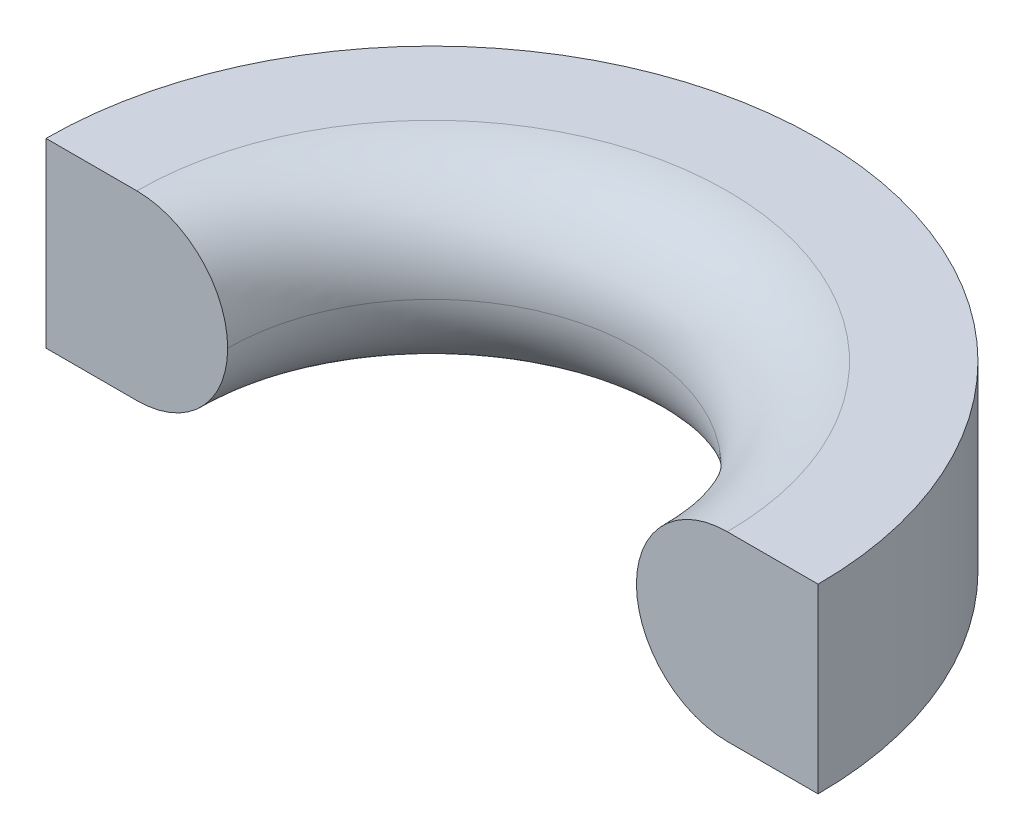
ISO-10303-21;
HEADER;
FILE_DESCRIPTION(('STEP AP214'),'2;1');
FILE_NAME('part.step','',(''),(''),'','','');
FILE_SCHEMA(('AUTOMOTIVE_DESIGN { 1 0 10303 214 1 1 1 1 }'));
ENDSEC;
DATA;
#1=APPLICATION_CONTEXT('core data for automotive mechanical design processes');
#2=APPLICATION_PROTOCOL_DEFINITION('international standard','automotive_design',2000,#1);
#3=PRODUCT_CONTEXT('',#1,'mechanical');
#4=PRODUCT('Part','Part','',(#3));
#5=PRODUCT_RELATED_PRODUCT_CATEGORY('part','',(#4));
#6=PRODUCT_DEFINITION_FORMATION('','',#4);
#7=PRODUCT_DEFINITION_CONTEXT('part definition',#1,'design');
#8=PRODUCT_DEFINITION('design','',#6,#7);
#9=PRODUCT_DEFINITION_SHAPE('','',#8);
#10=(LENGTH_UNIT() NAMED_UNIT(*) SI_UNIT(.MILLI.,.METRE.));
#11=(NAMED_UNIT(*) PLANE_ANGLE_UNIT() SI_UNIT($,.RADIAN.));
#12=(NAMED_UNIT(*) SI_UNIT($,.STERADIAN.) SOLID_ANGLE_UNIT());
#13=UNCERTAINTY_MEASURE_WITH_UNIT(LENGTH_MEASURE(1.E-05),#10,'distance_accuracy_value','');
#14=(GEOMETRIC_REPRESENTATION_CONTEXT(3) GLOBAL_UNCERTAINTY_ASSIGNED_CONTEXT((#13)) GLOBAL_UNIT_ASSIGNED_CONTEXT((#10,
#11,#12)) REPRESENTATION_CONTEXT('',''));
#15=CARTESIAN_POINT('',(0.,0.,0.));
#16=DIRECTION('',(0.,0.,1.));
#17=DIRECTION('',(1.,0.,0.));
#18=AXIS2_PLACEMENT_3D('',#15,#16,#17);
#19=CARTESIAN_POINT('',(4.25,2.,0.));
#20=DIRECTION('',(0.,0.,-1.));
#21=DIRECTION('',(-1.,0.,0.));
#22=AXIS2_PLACEMENT_3D('',#19,#20,#21);
#23=PLANE('',#22);
#24=CARTESIAN_POINT('',(3.25,1.,0.));
#25=DIRECTION('',(0.,0.,-1.));
#26=DIRECTION('',(-1.,0.,0.));
#27=AXIS2_PLACEMENT_3D('',#24,#25,#26);
#28=CIRCLE('',#27,1.);
#29=CARTESIAN_POINT('',(3.25,2.,0.));
#30=VERTEX_POINT('',#29);
#31=CARTESIAN_POINT('',(2.25,1.,0.));
#32=VERTEX_POINT('',#31);
#33=EDGE_CURVE('E97',#30,#32,#28,.F.);
#34=ORIENTED_EDGE('',*,*,#33,.T.);
#35=CARTESIAN_POINT('',(3.25,1.,0.));
#36=DIRECTION('',(0.,0.,-1.));
#37=DIRECTION('',(-1.,0.,0.));
#38=AXIS2_PLACEMENT_3D('',#35,#36,#37);
#39=CIRCLE('',#38,1.);
#40=CARTESIAN_POINT('',(3.25,0.,0.));
#41=VERTEX_POINT('',#40);
#42=EDGE_CURVE('E112',#32,#41,#39,.F.);
#43=ORIENTED_EDGE('',*,*,#42,.T.);
#44=DIRECTION('',(1.,0.,0.));
#45=VECTOR('',#44,1.);
#46=CARTESIAN_POINT('',(4.25,0.,0.));
#47=LINE('',#46,#45);
#48=CARTESIAN_POINT('',(4.25,0.,0.));
#49=VERTEX_POINT('',#48);
#50=EDGE_CURVE('E94',#41,#49,#47,.T.);
#51=ORIENTED_EDGE('',*,*,#50,.T.);
#52=DIRECTION('',(0.,-1.,0.));
#53=VECTOR('',#52,1.);
#54=CARTESIAN_POINT('',(4.25,2.,0.));
#55=LINE('',#54,#53);
#56=CARTESIAN_POINT('',(4.25,2.,0.));
#57=VERTEX_POINT('',#56);
#58=EDGE_CURVE('E92',#57,#49,#55,.T.);
#59=ORIENTED_EDGE('',*,*,#58,.F.);
#60=DIRECTION('',(1.,0.,0.));
#61=VECTOR('',#60,1.);
#62=CARTESIAN_POINT('',(4.25,2.,0.));
#63=LINE('',#62,#61);
#64=EDGE_CURVE('E80',#30,#57,#63,.T.);
#65=ORIENTED_EDGE('',*,*,#64,.F.);
#66=EDGE_LOOP('',(#34,#43,#51,#59,#65));
#67=FACE_BOUND('',#66,.T.);
#68=ADVANCED_FACE('F36',(#67),#23,.F.);
#69=CARTESIAN_POINT('',(0.,2.,0.));
#70=DIRECTION('',(0.,-1.,0.));
#71=DIRECTION('',(0.,0.,-1.));
#72=AXIS2_PLACEMENT_3D('',#69,#70,#71);
#73=CYLINDRICAL_SURFACE('',#72,4.25);
#74=CARTESIAN_POINT('',(0.,0.,0.));
#75=DIRECTION('',(0.,1.,0.));
#76=DIRECTION('',(0.,0.,-1.));
#77=AXIS2_PLACEMENT_3D('',#74,#75,#76);
#78=CIRCLE('',#77,4.25);
#79=CARTESIAN_POINT('',(-4.25,0.,0.));
#80=VERTEX_POINT('',#79);
#81=EDGE_CURVE('E107',#49,#80,#78,.T.);
#82=ORIENTED_EDGE('',*,*,#81,.T.);
#83=DIRECTION('',(0.,-1.,0.));
#84=VECTOR('',#83,1.);
#85=CARTESIAN_POINT('',(-4.25,2.,0.));
#86=LINE('',#85,#84);
#87=CARTESIAN_POINT('',(-4.25,2.,0.));
#88=VERTEX_POINT('',#87);
#89=EDGE_CURVE('E98',#88,#80,#86,.T.);
#90=ORIENTED_EDGE('',*,*,#89,.F.);
#91=CARTESIAN_POINT('',(0.,2.,0.));
#92=DIRECTION('',(0.,1.,0.));
#93=DIRECTION('',(0.,0.,-1.));
#94=AXIS2_PLACEMENT_3D('',#91,#92,#93);
#95=CIRCLE('',#94,4.25);
#96=EDGE_CURVE('E84',#57,#88,#95,.T.);
#97=ORIENTED_EDGE('',*,*,#96,.F.);
#98=ORIENTED_EDGE('',*,*,#58,.T.);
#99=EDGE_LOOP('',(#82,#90,#97,#98));
#100=FACE_BOUND('',#99,.T.);
#101=ADVANCED_FACE('F100',(#100),#73,.T.);
#102=CARTESIAN_POINT('',(-4.25,2.,0.));
#103=DIRECTION('',(0.,0.,-1.));
#104=DIRECTION('',(-1.,0.,0.));
#105=AXIS2_PLACEMENT_3D('',#102,#103,#104);
#106=PLANE('',#105);
#107=DIRECTION('',(1.,0.,0.));
#108=VECTOR('',#107,1.);
#109=CARTESIAN_POINT('',(-4.25,0.,0.));
#110=LINE('',#109,#108);
#111=CARTESIAN_POINT('',(-3.25,0.,0.));
#112=VERTEX_POINT('',#111);
#113=EDGE_CURVE('E89',#80,#112,#110,.T.);
#114=ORIENTED_EDGE('',*,*,#113,.T.);
#115=CARTESIAN_POINT('',(-3.25,1.,0.));
#116=DIRECTION('',(0.,0.,-1.));
#117=DIRECTION('',(-1.,0.,0.));
#118=AXIS2_PLACEMENT_3D('',#115,#116,#117);
#119=CIRCLE('',#118,1.);
#120=CARTESIAN_POINT('',(-2.25,1.,0.));
#121=VERTEX_POINT('',#120);
#122=EDGE_CURVE('E45',#112,#121,#119,.F.);
#123=ORIENTED_EDGE('',*,*,#122,.T.);
#124=CARTESIAN_POINT('',(-3.25,1.,0.));
#125=DIRECTION('',(0.,0.,-1.));
#126=DIRECTION('',(-1.,0.,0.));
#127=AXIS2_PLACEMENT_3D('',#124,#125,#126);
#128=CIRCLE('',#127,1.);
#129=CARTESIAN_POINT('',(-3.25,2.,0.));
#130=VERTEX_POINT('',#129);
#131=EDGE_CURVE('E52',#121,#130,#128,.F.);
#132=ORIENTED_EDGE('',*,*,#131,.T.);
#133=DIRECTION('',(1.,0.,0.));
#134=VECTOR('',#133,1.);
#135=CARTESIAN_POINT('',(-4.25,2.,0.));
#136=LINE('',#135,#134);
#137=EDGE_CURVE('E102',#88,#130,#136,.T.);
#138=ORIENTED_EDGE('',*,*,#137,.F.);
#139=ORIENTED_EDGE('',*,*,#89,.T.);
#140=EDGE_LOOP('',(#114,#123,#132,#138,#139));
#141=FACE_BOUND('',#140,.T.);
#142=ADVANCED_FACE('F124',(#141),#106,.F.);
#143=CARTESIAN_POINT('',(0.,2.,0.));
#144=DIRECTION('',(0.,-1.,0.));
#145=DIRECTION('',(0.,0.,-1.));
#146=AXIS2_PLACEMENT_3D('',#143,#144,#145);
#147=PLANE('',#146);
#148=ORIENTED_EDGE('',*,*,#137,.T.);
#149=CARTESIAN_POINT('',(0.,2.,0.));
#150=DIRECTION('',(0.,-1.,0.));
#151=DIRECTION('',(0.,0.,-1.));
#152=AXIS2_PLACEMENT_3D('',#149,#150,#151);
#153=CIRCLE('',#152,3.25);
#154=EDGE_CURVE('E11',#130,#30,#153,.T.);
#155=ORIENTED_EDGE('',*,*,#154,.T.);
#156=ORIENTED_EDGE('',*,*,#64,.T.);
#157=ORIENTED_EDGE('',*,*,#96,.T.);
#158=EDGE_LOOP('',(#148,#155,#156,#157));
#159=FACE_BOUND('',#158,.T.);
#160=ADVANCED_FACE('F82',(#159),#147,.F.);
#161=CARTESIAN_POINT('',(0.,0.,0.));
#162=DIRECTION('',(0.,-1.,0.));
#163=DIRECTION('',(0.,0.,-1.));
#164=AXIS2_PLACEMENT_3D('',#161,#162,#163);
#165=PLANE('',#164);
#166=ORIENTED_EDGE('',*,*,#50,.F.);
#167=CARTESIAN_POINT('',(0.,0.,0.));
#168=DIRECTION('',(0.,-1.,0.));
#169=DIRECTION('',(0.,0.,-1.));
#170=AXIS2_PLACEMENT_3D('',#167,#168,#169);
#171=CIRCLE('',#170,3.25);
#172=EDGE_CURVE('E114',#41,#112,#171,.F.);
#173=ORIENTED_EDGE('',*,*,#172,.T.);
#174=ORIENTED_EDGE('',*,*,#113,.F.);
#175=ORIENTED_EDGE('',*,*,#81,.F.);
#176=EDGE_LOOP('',(#166,#173,#174,#175));
#177=FACE_BOUND('',#176,.T.);
#178=ADVANCED_FACE('F121',(#177),#165,.T.);
#179=CARTESIAN_POINT('',(0.,1.,0.));
#180=DIRECTION('',(0.,-1.,0.));
#181=DIRECTION('',(0.,0.,-1.));
#182=AXIS2_PLACEMENT_3D('',#179,#180,#181);
#183=TOROIDAL_SURFACE('',#182,3.25,1.);
#184=ORIENTED_EDGE('',*,*,#154,.F.);
#185=ORIENTED_EDGE('',*,*,#131,.F.);
#186=CARTESIAN_POINT('',(0.,1.,0.));
#187=DIRECTION('',(0.,-1.,0.));
#188=DIRECTION('',(0.,0.,-1.));
#189=AXIS2_PLACEMENT_3D('',#186,#187,#188);
#190=CIRCLE('',#189,2.25);
#191=EDGE_CURVE('E40',#32,#121,#190,.F.);
#192=ORIENTED_EDGE('',*,*,#191,.F.);
#193=ORIENTED_EDGE('',*,*,#33,.F.);
#194=EDGE_LOOP('',(#184,#185,#192,#193));
#195=FACE_BOUND('',#194,.T.);
#196=ADVANCED_FACE('F38',(#195),#183,.T.);
#197=CARTESIAN_POINT('',(0.,1.,0.));
#198=DIRECTION('',(0.,-1.,0.));
#199=DIRECTION('',(0.,0.,-1.));
#200=AXIS2_PLACEMENT_3D('',#197,#198,#199);
#201=TOROIDAL_SURFACE('',#200,3.25,1.);
#202=ORIENTED_EDGE('',*,*,#122,.F.);
#203=ORIENTED_EDGE('',*,*,#172,.F.);
#204=ORIENTED_EDGE('',*,*,#42,.F.);
#205=ORIENTED_EDGE('',*,*,#191,.T.);
#206=EDGE_LOOP('',(#202,#203,#204,#205));
#207=FACE_BOUND('',#206,.T.);
#208=ADVANCED_FACE('F128',(#207),#201,.T.);
#209=CLOSED_SHELL('',(#68,#101,#142,#160,#178,#196,#208));
#210=MANIFOLD_SOLID_BREP('B2',#209);
#211=ADVANCED_BREP_SHAPE_REPRESENTATION('',(#18,#210),#14);
#212=SHAPE_DEFINITION_REPRESENTATION(#9,#211);
ENDSEC;
END-ISO-10303-21;
